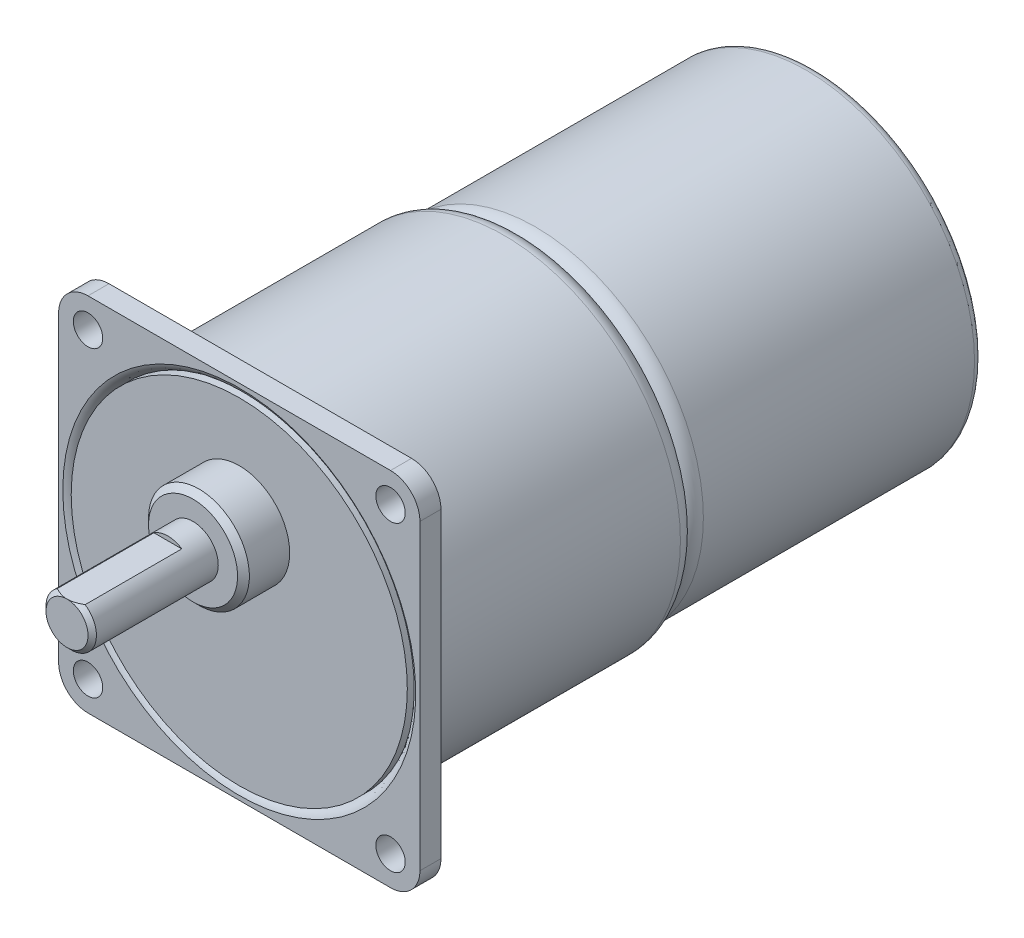
ISO-10303-21;
HEADER;
FILE_DESCRIPTION(('STEP AP214'),'2;1');
FILE_NAME('part.step','',(''),(''),'','','');
FILE_SCHEMA(('AUTOMOTIVE_DESIGN { 1 0 10303 214 1 1 1 1 }'));
ENDSEC;
DATA;
#1=APPLICATION_CONTEXT('core data for automotive mechanical design processes');
#2=APPLICATION_PROTOCOL_DEFINITION('international standard','automotive_design',2000,#1);
#3=PRODUCT_CONTEXT('',#1,'mechanical');
#4=PRODUCT('Part','Part','',(#3));
#5=PRODUCT_RELATED_PRODUCT_CATEGORY('part','',(#4));
#6=PRODUCT_DEFINITION_FORMATION('','',#4);
#7=PRODUCT_DEFINITION_CONTEXT('part definition',#1,'design');
#8=PRODUCT_DEFINITION('design','',#6,#7);
#9=PRODUCT_DEFINITION_SHAPE('','',#8);
#10=(LENGTH_UNIT() NAMED_UNIT(*) SI_UNIT(.MILLI.,.METRE.));
#11=(NAMED_UNIT(*) PLANE_ANGLE_UNIT() SI_UNIT($,.RADIAN.));
#12=(NAMED_UNIT(*) SI_UNIT($,.STERADIAN.) SOLID_ANGLE_UNIT());
#13=UNCERTAINTY_MEASURE_WITH_UNIT(LENGTH_MEASURE(1.E-05),#10,'distance_accuracy_value','');
#14=(GEOMETRIC_REPRESENTATION_CONTEXT(3) GLOBAL_UNCERTAINTY_ASSIGNED_CONTEXT((#13)) GLOBAL_UNIT_ASSIGNED_CONTEXT((#10,
#11,#12)) REPRESENTATION_CONTEXT('',''));
#15=CARTESIAN_POINT('',(0.,0.,0.));
#16=DIRECTION('',(0.,0.,1.));
#17=DIRECTION('',(1.,0.,0.));
#18=AXIS2_PLACEMENT_3D('',#15,#16,#17);
#19=CARTESIAN_POINT('',(3.5,-3.5,2.5));
#20=DIRECTION('',(0.,0.,1.));
#21=DIRECTION('',(1.,0.,0.));
#22=AXIS2_PLACEMENT_3D('',#19,#20,#21);
#23=PLANE('',#22);
#24=CARTESIAN_POINT('',(39.5,-39.5,2.5));
#25=DIRECTION('',(0.,0.,1.));
#26=DIRECTION('',(1.,0.,0.));
#27=AXIS2_PLACEMENT_3D('',#24,#25,#26);
#28=CIRCLE('',#27,1.75);
#29=CARTESIAN_POINT('',(41.25,-39.5,2.5));
#30=VERTEX_POINT('',#29);
#31=EDGE_CURVE('E148',#30,#30,#28,.T.);
#32=ORIENTED_EDGE('',*,*,#31,.F.);
#33=EDGE_LOOP('',(#32));
#34=FACE_BOUND('',#33,.T.);
#35=CARTESIAN_POINT('',(3.5,-39.5,2.5));
#36=DIRECTION('',(0.,0.,1.));
#37=DIRECTION('',(1.,0.,0.));
#38=AXIS2_PLACEMENT_3D('',#35,#36,#37);
#39=CIRCLE('',#38,1.75);
#40=CARTESIAN_POINT('',(5.25000000000001,-39.5,2.5));
#41=VERTEX_POINT('',#40);
#42=EDGE_CURVE('E160',#41,#41,#39,.T.);
#43=ORIENTED_EDGE('',*,*,#42,.F.);
#44=EDGE_LOOP('',(#43));
#45=FACE_BOUND('',#44,.T.);
#46=CARTESIAN_POINT('',(3.5,-3.5,2.5));
#47=DIRECTION('',(0.,0.,1.));
#48=DIRECTION('',(1.,0.,0.));
#49=AXIS2_PLACEMENT_3D('',#46,#47,#48);
#50=CIRCLE('',#49,3.5);
#51=CARTESIAN_POINT('',(3.50000000000002,0.,2.5));
#52=VERTEX_POINT('',#51);
#53=CARTESIAN_POINT('',(0.,-3.50000000000002,2.5));
#54=VERTEX_POINT('',#53);
#55=EDGE_CURVE('E172',#52,#54,#50,.T.);
#56=ORIENTED_EDGE('',*,*,#55,.T.);
#57=DIRECTION('',(0.,-1.,0.));
#58=VECTOR('',#57,1.);
#59=CARTESIAN_POINT('',(0.,-3.50000000000002,2.5));
#60=LINE('',#59,#58);
#61=CARTESIAN_POINT('',(0.,-39.5,2.5));
#62=VERTEX_POINT('',#61);
#63=EDGE_CURVE('E175',#54,#62,#60,.T.);
#64=ORIENTED_EDGE('',*,*,#63,.T.);
#65=CARTESIAN_POINT('',(3.5,-39.5,2.5));
#66=DIRECTION('',(0.,0.,1.));
#67=DIRECTION('',(1.,0.,0.));
#68=AXIS2_PLACEMENT_3D('',#65,#66,#67);
#69=CIRCLE('',#68,3.5);
#70=CARTESIAN_POINT('',(3.50000000000003,-43.,2.5));
#71=VERTEX_POINT('',#70);
#72=EDGE_CURVE('E178',#62,#71,#69,.T.);
#73=ORIENTED_EDGE('',*,*,#72,.T.);
#74=DIRECTION('',(1.,0.,0.));
#75=VECTOR('',#74,1.);
#76=CARTESIAN_POINT('',(3.50000000000003,-43.,2.5));
#77=LINE('',#76,#75);
#78=CARTESIAN_POINT('',(39.5,-43.,2.5));
#79=VERTEX_POINT('',#78);
#80=EDGE_CURVE('E180',#71,#79,#77,.T.);
#81=ORIENTED_EDGE('',*,*,#80,.T.);
#82=CARTESIAN_POINT('',(39.5,-39.5,2.5));
#83=DIRECTION('',(0.,0.,1.));
#84=DIRECTION('',(1.,0.,0.));
#85=AXIS2_PLACEMENT_3D('',#82,#83,#84);
#86=CIRCLE('',#85,3.5);
#87=CARTESIAN_POINT('',(43.,-39.5,2.5));
#88=VERTEX_POINT('',#87);
#89=EDGE_CURVE('E182',#79,#88,#86,.T.);
#90=ORIENTED_EDGE('',*,*,#89,.T.);
#91=DIRECTION('',(0.,1.,0.));
#92=VECTOR('',#91,1.);
#93=CARTESIAN_POINT('',(43.,-3.50000000000002,2.5));
#94=LINE('',#93,#92);
#95=CARTESIAN_POINT('',(43.,-3.50000000000002,2.5));
#96=VERTEX_POINT('',#95);
#97=EDGE_CURVE('E184',#88,#96,#94,.T.);
#98=ORIENTED_EDGE('',*,*,#97,.T.);
#99=CARTESIAN_POINT('',(39.5,-3.5,2.5));
#100=DIRECTION('',(0.,0.,1.));
#101=DIRECTION('',(-1.,0.,0.));
#102=AXIS2_PLACEMENT_3D('',#99,#100,#101);
#103=CIRCLE('',#102,3.5);
#104=CARTESIAN_POINT('',(39.5,0.,2.5));
#105=VERTEX_POINT('',#104);
#106=EDGE_CURVE('E186',#96,#105,#103,.T.);
#107=ORIENTED_EDGE('',*,*,#106,.T.);
#108=DIRECTION('',(-1.,0.,0.));
#109=VECTOR('',#108,1.);
#110=CARTESIAN_POINT('',(3.50000000000002,0.,2.5));
#111=LINE('',#110,#109);
#112=EDGE_CURVE('E188',#105,#52,#111,.T.);
#113=ORIENTED_EDGE('',*,*,#112,.T.);
#114=EDGE_LOOP('',(#56,#64,#73,#81,#90,#98,#107,#113));
#115=FACE_BOUND('',#114,.T.);
#116=CARTESIAN_POINT('',(39.5,-3.5,2.5));
#117=DIRECTION('',(0.,0.,1.));
#118=DIRECTION('',(1.,0.,0.));
#119=AXIS2_PLACEMENT_3D('',#116,#117,#118);
#120=CIRCLE('',#119,1.75);
#121=CARTESIAN_POINT('',(41.25,-3.5,2.5));
#122=VERTEX_POINT('',#121);
#123=EDGE_CURVE('E166',#122,#122,#120,.T.);
#124=ORIENTED_EDGE('',*,*,#123,.F.);
#125=EDGE_LOOP('',(#124));
#126=FACE_BOUND('',#125,.T.);
#127=CARTESIAN_POINT('',(3.5,-3.50000000000001,2.5));
#128=DIRECTION('',(0.,0.,1.));
#129=DIRECTION('',(1.,0.,0.));
#130=AXIS2_PLACEMENT_3D('',#127,#128,#129);
#131=CIRCLE('',#130,1.75);
#132=CARTESIAN_POINT('',(5.25,-3.50000000000001,2.5));
#133=VERTEX_POINT('',#132);
#134=EDGE_CURVE('E154',#133,#133,#131,.T.);
#135=ORIENTED_EDGE('',*,*,#134,.F.);
#136=EDGE_LOOP('',(#135));
#137=FACE_BOUND('',#136,.T.);
#138=CARTESIAN_POINT('',(21.5,-21.5,2.5));
#139=DIRECTION('',(0.,0.,-1.));
#140=DIRECTION('',(-1.,0.,0.));
#141=AXIS2_PLACEMENT_3D('',#138,#139,#140);
#142=CIRCLE('',#141,21.);
#143=CARTESIAN_POINT('',(0.500000000000011,-21.5,2.5));
#144=VERTEX_POINT('',#143);
#145=EDGE_CURVE('E132',#144,#144,#142,.T.);
#146=ORIENTED_EDGE('',*,*,#145,.T.);
#147=EDGE_LOOP('',(#146));
#148=FACE_BOUND('',#147,.T.);
#149=ADVANCED_FACE('F36',(#34,#45,#115,#126,#137,#148),#23,.T.);
#150=CARTESIAN_POINT('',(3.5,-3.5,0.));
#151=DIRECTION('',(0.,0.,1.));
#152=DIRECTION('',(1.,0.,0.));
#153=AXIS2_PLACEMENT_3D('',#150,#151,#152);
#154=PLANE('',#153);
#155=CARTESIAN_POINT('',(21.5,-21.5,0.));
#156=DIRECTION('',(0.,0.,1.));
#157=DIRECTION('',(1.,0.,0.));
#158=AXIS2_PLACEMENT_3D('',#155,#156,#157);
#159=CIRCLE('',#158,21.);
#160=CARTESIAN_POINT('',(42.5,-21.5,0.));
#161=VERTEX_POINT('',#160);
#162=EDGE_CURVE('E391',#161,#161,#159,.F.);
#163=ORIENTED_EDGE('',*,*,#162,.F.);
#164=EDGE_LOOP('',(#163));
#165=FACE_BOUND('',#164,.T.);
#166=CARTESIAN_POINT('',(3.5,-3.5,0.));
#167=DIRECTION('',(0.,0.,1.));
#168=DIRECTION('',(1.,0.,0.));
#169=AXIS2_PLACEMENT_3D('',#166,#167,#168);
#170=CIRCLE('',#169,3.5);
#171=CARTESIAN_POINT('',(3.50000000000002,0.,0.));
#172=VERTEX_POINT('',#171);
#173=CARTESIAN_POINT('',(0.,-3.50000000000002,0.));
#174=VERTEX_POINT('',#173);
#175=EDGE_CURVE('E169',#172,#174,#170,.T.);
#176=ORIENTED_EDGE('',*,*,#175,.F.);
#177=DIRECTION('',(-1.,0.,0.));
#178=VECTOR('',#177,1.);
#179=CARTESIAN_POINT('',(3.50000000000002,0.,0.));
#180=LINE('',#179,#178);
#181=CARTESIAN_POINT('',(39.5,0.,0.));
#182=VERTEX_POINT('',#181);
#183=EDGE_CURVE('E176',#182,#172,#180,.T.);
#184=ORIENTED_EDGE('',*,*,#183,.F.);
#185=CARTESIAN_POINT('',(39.5,-3.5,0.));
#186=DIRECTION('',(0.,0.,1.));
#187=DIRECTION('',(-1.,0.,0.));
#188=AXIS2_PLACEMENT_3D('',#185,#186,#187);
#189=CIRCLE('',#188,3.5);
#190=CARTESIAN_POINT('',(43.,-3.50000000000002,0.));
#191=VERTEX_POINT('',#190);
#192=EDGE_CURVE('E203',#191,#182,#189,.T.);
#193=ORIENTED_EDGE('',*,*,#192,.F.);
#194=DIRECTION('',(0.,1.,0.));
#195=VECTOR('',#194,1.);
#196=CARTESIAN_POINT('',(43.,-3.50000000000002,0.));
#197=LINE('',#196,#195);
#198=CARTESIAN_POINT('',(43.,-39.5,0.));
#199=VERTEX_POINT('',#198);
#200=EDGE_CURVE('E201',#199,#191,#197,.T.);
#201=ORIENTED_EDGE('',*,*,#200,.F.);
#202=CARTESIAN_POINT('',(39.5,-39.5,0.));
#203=DIRECTION('',(0.,0.,1.));
#204=DIRECTION('',(1.,0.,0.));
#205=AXIS2_PLACEMENT_3D('',#202,#203,#204);
#206=CIRCLE('',#205,3.5);
#207=CARTESIAN_POINT('',(39.5,-43.,0.));
#208=VERTEX_POINT('',#207);
#209=EDGE_CURVE('E199',#208,#199,#206,.T.);
#210=ORIENTED_EDGE('',*,*,#209,.F.);
#211=DIRECTION('',(1.,0.,0.));
#212=VECTOR('',#211,1.);
#213=CARTESIAN_POINT('',(3.50000000000003,-43.,0.));
#214=LINE('',#213,#212);
#215=CARTESIAN_POINT('',(3.50000000000003,-43.,0.));
#216=VERTEX_POINT('',#215);
#217=EDGE_CURVE('E197',#216,#208,#214,.T.);
#218=ORIENTED_EDGE('',*,*,#217,.F.);
#219=CARTESIAN_POINT('',(3.5,-39.5,0.));
#220=DIRECTION('',(0.,0.,1.));
#221=DIRECTION('',(1.,0.,0.));
#222=AXIS2_PLACEMENT_3D('',#219,#220,#221);
#223=CIRCLE('',#222,3.5);
#224=CARTESIAN_POINT('',(0.,-39.5,0.));
#225=VERTEX_POINT('',#224);
#226=EDGE_CURVE('E195',#225,#216,#223,.T.);
#227=ORIENTED_EDGE('',*,*,#226,.F.);
#228=DIRECTION('',(0.,-1.,0.));
#229=VECTOR('',#228,1.);
#230=CARTESIAN_POINT('',(0.,-3.50000000000002,0.));
#231=LINE('',#230,#229);
#232=EDGE_CURVE('E193',#174,#225,#231,.T.);
#233=ORIENTED_EDGE('',*,*,#232,.F.);
#234=EDGE_LOOP('',(#176,#184,#193,#201,#210,#218,#227,#233));
#235=FACE_BOUND('',#234,.T.);
#236=CARTESIAN_POINT('',(39.5,-3.5,0.));
#237=DIRECTION('',(0.,0.,1.));
#238=DIRECTION('',(1.,0.,0.));
#239=AXIS2_PLACEMENT_3D('',#236,#237,#238);
#240=CIRCLE('',#239,1.75);
#241=CARTESIAN_POINT('',(41.25,-3.5,0.));
#242=VERTEX_POINT('',#241);
#243=EDGE_CURVE('E163',#242,#242,#240,.T.);
#244=ORIENTED_EDGE('',*,*,#243,.T.);
#245=EDGE_LOOP('',(#244));
#246=FACE_BOUND('',#245,.T.);
#247=CARTESIAN_POINT('',(3.5,-39.5,0.));
#248=DIRECTION('',(0.,0.,1.));
#249=DIRECTION('',(1.,0.,0.));
#250=AXIS2_PLACEMENT_3D('',#247,#248,#249);
#251=CIRCLE('',#250,1.75);
#252=CARTESIAN_POINT('',(5.25000000000001,-39.5,0.));
#253=VERTEX_POINT('',#252);
#254=EDGE_CURVE('E157',#253,#253,#251,.T.);
#255=ORIENTED_EDGE('',*,*,#254,.T.);
#256=EDGE_LOOP('',(#255));
#257=FACE_BOUND('',#256,.T.);
#258=CARTESIAN_POINT('',(3.5,-3.50000000000001,0.));
#259=DIRECTION('',(0.,0.,1.));
#260=DIRECTION('',(1.,0.,0.));
#261=AXIS2_PLACEMENT_3D('',#258,#259,#260);
#262=CIRCLE('',#261,1.75);
#263=CARTESIAN_POINT('',(5.25,-3.50000000000001,0.));
#264=VERTEX_POINT('',#263);
#265=EDGE_CURVE('E151',#264,#264,#262,.T.);
#266=ORIENTED_EDGE('',*,*,#265,.T.);
#267=EDGE_LOOP('',(#266));
#268=FACE_BOUND('',#267,.T.);
#269=CARTESIAN_POINT('',(39.5,-39.5,0.));
#270=DIRECTION('',(0.,0.,1.));
#271=DIRECTION('',(1.,0.,0.));
#272=AXIS2_PLACEMENT_3D('',#269,#270,#271);
#273=CIRCLE('',#272,1.75);
#274=CARTESIAN_POINT('',(41.25,-39.5,0.));
#275=VERTEX_POINT('',#274);
#276=EDGE_CURVE('E147',#275,#275,#273,.T.);
#277=ORIENTED_EDGE('',*,*,#276,.T.);
#278=EDGE_LOOP('',(#277));
#279=FACE_BOUND('',#278,.T.);
#280=ADVANCED_FACE('F296',(#165,#235,#246,#257,#268,#279),#154,.F.);
#281=CARTESIAN_POINT('',(3.5,-3.5,2.5));
#282=DIRECTION('',(0.,0.,-1.));
#283=DIRECTION('',(-1.,0.,0.));
#284=AXIS2_PLACEMENT_3D('',#281,#282,#283);
#285=CYLINDRICAL_SURFACE('',#284,3.5);
#286=ORIENTED_EDGE('',*,*,#175,.T.);
#287=DIRECTION('',(0.,0.,-1.));
#288=VECTOR('',#287,1.);
#289=CARTESIAN_POINT('',(0.,-3.50000000000002,2.5));
#290=LINE('',#289,#288);
#291=EDGE_CURVE('E144',#54,#174,#290,.T.);
#292=ORIENTED_EDGE('',*,*,#291,.F.);
#293=ORIENTED_EDGE('',*,*,#55,.F.);
#294=DIRECTION('',(0.,0.,-1.));
#295=VECTOR('',#294,1.);
#296=CARTESIAN_POINT('',(3.50000000000002,0.,2.5));
#297=LINE('',#296,#295);
#298=EDGE_CURVE('E190',#52,#172,#297,.T.);
#299=ORIENTED_EDGE('',*,*,#298,.T.);
#300=EDGE_LOOP('',(#286,#292,#293,#299));
#301=FACE_BOUND('',#300,.T.);
#302=ADVANCED_FACE('F300',(#301),#285,.T.);
#303=CARTESIAN_POINT('',(0.,-3.50000000000002,2.5));
#304=DIRECTION('',(1.,0.,0.));
#305=DIRECTION('',(0.,1.,0.));
#306=AXIS2_PLACEMENT_3D('',#303,#304,#305);
#307=PLANE('',#306);
#308=ORIENTED_EDGE('',*,*,#232,.T.);
#309=DIRECTION('',(0.,0.,-1.));
#310=VECTOR('',#309,1.);
#311=CARTESIAN_POINT('',(0.,-39.5,2.5));
#312=LINE('',#311,#310);
#313=EDGE_CURVE('E223',#62,#225,#312,.T.);
#314=ORIENTED_EDGE('',*,*,#313,.F.);
#315=ORIENTED_EDGE('',*,*,#63,.F.);
#316=ORIENTED_EDGE('',*,*,#291,.T.);
#317=EDGE_LOOP('',(#308,#314,#315,#316));
#318=FACE_BOUND('',#317,.T.);
#319=ADVANCED_FACE('F324',(#318),#307,.F.);
#320=CARTESIAN_POINT('',(3.5,-39.5,2.5));
#321=DIRECTION('',(0.,0.,-1.));
#322=DIRECTION('',(-1.,0.,0.));
#323=AXIS2_PLACEMENT_3D('',#320,#321,#322);
#324=CYLINDRICAL_SURFACE('',#323,3.5);
#325=ORIENTED_EDGE('',*,*,#226,.T.);
#326=DIRECTION('',(0.,0.,-1.));
#327=VECTOR('',#326,1.);
#328=CARTESIAN_POINT('',(3.50000000000003,-43.,2.5));
#329=LINE('',#328,#327);
#330=EDGE_CURVE('E220',#71,#216,#329,.T.);
#331=ORIENTED_EDGE('',*,*,#330,.F.);
#332=ORIENTED_EDGE('',*,*,#72,.F.);
#333=ORIENTED_EDGE('',*,*,#313,.T.);
#334=EDGE_LOOP('',(#325,#331,#332,#333));
#335=FACE_BOUND('',#334,.T.);
#336=ADVANCED_FACE('F320',(#335),#324,.T.);
#337=CARTESIAN_POINT('',(3.50000000000003,-43.,2.5));
#338=DIRECTION('',(0.,1.,0.));
#339=DIRECTION('',(0.,0.,1.));
#340=AXIS2_PLACEMENT_3D('',#337,#338,#339);
#341=PLANE('',#340);
#342=ORIENTED_EDGE('',*,*,#217,.T.);
#343=DIRECTION('',(0.,0.,-1.));
#344=VECTOR('',#343,1.);
#345=CARTESIAN_POINT('',(39.5,-43.,2.5));
#346=LINE('',#345,#344);
#347=EDGE_CURVE('E217',#79,#208,#346,.T.);
#348=ORIENTED_EDGE('',*,*,#347,.F.);
#349=ORIENTED_EDGE('',*,*,#80,.F.);
#350=ORIENTED_EDGE('',*,*,#330,.T.);
#351=EDGE_LOOP('',(#342,#348,#349,#350));
#352=FACE_BOUND('',#351,.T.);
#353=ADVANCED_FACE('F316',(#352),#341,.F.);
#354=CARTESIAN_POINT('',(39.5,-39.5,2.5));
#355=DIRECTION('',(0.,0.,-1.));
#356=DIRECTION('',(-1.,0.,0.));
#357=AXIS2_PLACEMENT_3D('',#354,#355,#356);
#358=CYLINDRICAL_SURFACE('',#357,3.5);
#359=ORIENTED_EDGE('',*,*,#209,.T.);
#360=DIRECTION('',(0.,0.,-1.));
#361=VECTOR('',#360,1.);
#362=CARTESIAN_POINT('',(43.,-39.5,2.5));
#363=LINE('',#362,#361);
#364=EDGE_CURVE('E214',#88,#199,#363,.T.);
#365=ORIENTED_EDGE('',*,*,#364,.F.);
#366=ORIENTED_EDGE('',*,*,#89,.F.);
#367=ORIENTED_EDGE('',*,*,#347,.T.);
#368=EDGE_LOOP('',(#359,#365,#366,#367));
#369=FACE_BOUND('',#368,.T.);
#370=ADVANCED_FACE('F312',(#369),#358,.T.);
#371=CARTESIAN_POINT('',(43.,-3.50000000000002,2.5));
#372=DIRECTION('',(-1.,0.,0.));
#373=DIRECTION('',(0.,-1.,0.));
#374=AXIS2_PLACEMENT_3D('',#371,#372,#373);
#375=PLANE('',#374);
#376=ORIENTED_EDGE('',*,*,#200,.T.);
#377=DIRECTION('',(0.,0.,-1.));
#378=VECTOR('',#377,1.);
#379=CARTESIAN_POINT('',(43.,-3.50000000000002,2.5));
#380=LINE('',#379,#378);
#381=EDGE_CURVE('E211',#96,#191,#380,.T.);
#382=ORIENTED_EDGE('',*,*,#381,.F.);
#383=ORIENTED_EDGE('',*,*,#97,.F.);
#384=ORIENTED_EDGE('',*,*,#364,.T.);
#385=EDGE_LOOP('',(#376,#382,#383,#384));
#386=FACE_BOUND('',#385,.T.);
#387=ADVANCED_FACE('F308',(#386),#375,.F.);
#388=CARTESIAN_POINT('',(39.5,-3.5,2.5));
#389=DIRECTION('',(0.,0.,-1.));
#390=DIRECTION('',(-1.,0.,0.));
#391=AXIS2_PLACEMENT_3D('',#388,#389,#390);
#392=CYLINDRICAL_SURFACE('',#391,3.5);
#393=ORIENTED_EDGE('',*,*,#192,.T.);
#394=DIRECTION('',(0.,0.,-1.));
#395=VECTOR('',#394,1.);
#396=CARTESIAN_POINT('',(39.5,0.,2.5));
#397=LINE('',#396,#395);
#398=EDGE_CURVE('E208',#105,#182,#397,.T.);
#399=ORIENTED_EDGE('',*,*,#398,.F.);
#400=ORIENTED_EDGE('',*,*,#106,.F.);
#401=ORIENTED_EDGE('',*,*,#381,.T.);
#402=EDGE_LOOP('',(#393,#399,#400,#401));
#403=FACE_BOUND('',#402,.T.);
#404=ADVANCED_FACE('F304',(#403),#392,.T.);
#405=CARTESIAN_POINT('',(3.50000000000002,0.,2.5));
#406=DIRECTION('',(0.,-1.,0.));
#407=DIRECTION('',(0.,0.,-1.));
#408=AXIS2_PLACEMENT_3D('',#405,#406,#407);
#409=PLANE('',#408);
#410=ORIENTED_EDGE('',*,*,#183,.T.);
#411=ORIENTED_EDGE('',*,*,#298,.F.);
#412=ORIENTED_EDGE('',*,*,#112,.F.);
#413=ORIENTED_EDGE('',*,*,#398,.T.);
#414=EDGE_LOOP('',(#410,#411,#412,#413));
#415=FACE_BOUND('',#414,.T.);
#416=ADVANCED_FACE('F292',(#415),#409,.F.);
#417=CARTESIAN_POINT('',(39.5,-3.5,2.5));
#418=DIRECTION('',(0.,0.,-1.));
#419=DIRECTION('',(-1.,0.,0.));
#420=AXIS2_PLACEMENT_3D('',#417,#418,#419);
#421=CYLINDRICAL_SURFACE('',#420,1.75);
#422=ORIENTED_EDGE('',*,*,#123,.T.);
#423=EDGE_LOOP('',(#422));
#424=FACE_BOUND('',#423,.T.);
#425=ORIENTED_EDGE('',*,*,#243,.F.);
#426=EDGE_LOOP('',(#425));
#427=FACE_BOUND('',#426,.T.);
#428=ADVANCED_FACE('F288',(#424,#427),#421,.F.);
#429=CARTESIAN_POINT('',(3.5,-39.5,2.5));
#430=DIRECTION('',(0.,0.,-1.));
#431=DIRECTION('',(-1.,0.,0.));
#432=AXIS2_PLACEMENT_3D('',#429,#430,#431);
#433=CYLINDRICAL_SURFACE('',#432,1.75);
#434=ORIENTED_EDGE('',*,*,#42,.T.);
#435=EDGE_LOOP('',(#434));
#436=FACE_BOUND('',#435,.T.);
#437=ORIENTED_EDGE('',*,*,#254,.F.);
#438=EDGE_LOOP('',(#437));
#439=FACE_BOUND('',#438,.T.);
#440=ADVANCED_FACE('F284',(#436,#439),#433,.F.);
#441=CARTESIAN_POINT('',(3.5,-3.50000000000001,2.5));
#442=DIRECTION('',(0.,0.,-1.));
#443=DIRECTION('',(-1.,0.,0.));
#444=AXIS2_PLACEMENT_3D('',#441,#442,#443);
#445=CYLINDRICAL_SURFACE('',#444,1.75);
#446=ORIENTED_EDGE('',*,*,#134,.T.);
#447=EDGE_LOOP('',(#446));
#448=FACE_BOUND('',#447,.T.);
#449=ORIENTED_EDGE('',*,*,#265,.F.);
#450=EDGE_LOOP('',(#449));
#451=FACE_BOUND('',#450,.T.);
#452=ADVANCED_FACE('F280',(#448,#451),#445,.F.);
#453=CARTESIAN_POINT('',(39.5,-39.5,2.5));
#454=DIRECTION('',(0.,0.,-1.));
#455=DIRECTION('',(-1.,0.,0.));
#456=AXIS2_PLACEMENT_3D('',#453,#454,#455);
#457=CYLINDRICAL_SURFACE('',#456,1.75);
#458=ORIENTED_EDGE('',*,*,#31,.T.);
#459=EDGE_LOOP('',(#458));
#460=FACE_BOUND('',#459,.T.);
#461=ORIENTED_EDGE('',*,*,#276,.F.);
#462=EDGE_LOOP('',(#461));
#463=FACE_BOUND('',#462,.T.);
#464=ADVANCED_FACE('F277',(#460,#463),#457,.F.);
#465=CARTESIAN_POINT('',(21.5,-21.5,-31.));
#466=DIRECTION('',(0.,0.,1.));
#467=DIRECTION('',(1.,0.,0.));
#468=AXIS2_PLACEMENT_3D('',#465,#466,#467);
#469=CYLINDRICAL_SURFACE('',#468,21.);
#470=CARTESIAN_POINT('',(21.5,-21.5,-29.));
#471=DIRECTION('',(0.,0.,-1.));
#472=DIRECTION('',(-1.,0.,0.));
#473=AXIS2_PLACEMENT_3D('',#470,#471,#472);
#474=CIRCLE('',#473,21.);
#475=CARTESIAN_POINT('',(0.5,-21.5,-29.));
#476=VERTEX_POINT('',#475);
#477=EDGE_CURVE('E382',#476,#476,#474,.F.);
#478=ORIENTED_EDGE('',*,*,#477,.T.);
#479=EDGE_LOOP('',(#478));
#480=FACE_BOUND('',#479,.T.);
#481=ORIENTED_EDGE('',*,*,#162,.T.);
#482=EDGE_LOOP('',(#481));
#483=FACE_BOUND('',#482,.T.);
#484=ADVANCED_FACE('F255',(#480,#483),#469,.T.);
#485=CARTESIAN_POINT('',(21.5,-21.5,-29.));
#486=DIRECTION('',(0.,0.,-1.));
#487=DIRECTION('',(-1.,0.,0.));
#488=AXIS2_PLACEMENT_3D('',#485,#486,#487);
#489=TOROIDAL_SURFACE('',#488,19.,2.);
#490=ORIENTED_EDGE('',*,*,#477,.F.);
#491=EDGE_LOOP('',(#490));
#492=FACE_BOUND('',#491,.T.);
#493=CARTESIAN_POINT('',(21.5,-21.5,-31.));
#494=DIRECTION('',(0.,0.,-1.));
#495=DIRECTION('',(-1.,0.,0.));
#496=AXIS2_PLACEMENT_3D('',#493,#494,#495);
#497=CIRCLE('',#496,19.);
#498=CARTESIAN_POINT('',(2.5,-21.5,-31.));
#499=VERTEX_POINT('',#498);
#500=EDGE_CURVE('E386',#499,#499,#497,.T.);
#501=ORIENTED_EDGE('',*,*,#500,.F.);
#502=EDGE_LOOP('',(#501));
#503=FACE_BOUND('',#502,.T.);
#504=ADVANCED_FACE('F370',(#492,#503),#489,.T.);
#505=CARTESIAN_POINT('',(21.5,-21.5,-66.));
#506=DIRECTION('',(0.,0.,1.));
#507=DIRECTION('',(1.,0.,0.));
#508=AXIS2_PLACEMENT_3D('',#505,#506,#507);
#509=CYLINDRICAL_SURFACE('',#508,20.);
#510=CARTESIAN_POINT('',(21.5,-21.5,-65.));
#511=DIRECTION('',(0.,0.,-1.));
#512=DIRECTION('',(-1.,0.,0.));
#513=AXIS2_PLACEMENT_3D('',#510,#511,#512);
#514=CIRCLE('',#513,20.);
#515=CARTESIAN_POINT('',(1.5,-21.5,-65.));
#516=VERTEX_POINT('',#515);
#517=EDGE_CURVE('E11',#516,#516,#514,.F.);
#518=ORIENTED_EDGE('',*,*,#517,.T.);
#519=EDGE_LOOP('',(#518));
#520=FACE_BOUND('',#519,.T.);
#521=CARTESIAN_POINT('',(21.5,-21.5,-32.7320508075689));
#522=DIRECTION('',(0.,0.,1.));
#523=DIRECTION('',(1.,0.,0.));
#524=AXIS2_PLACEMENT_3D('',#521,#522,#523);
#525=CIRCLE('',#524,20.);
#526=CARTESIAN_POINT('',(41.5,-21.5,-32.7320508075689));
#527=VERTEX_POINT('',#526);
#528=EDGE_CURVE('E380',#527,#527,#525,.F.);
#529=ORIENTED_EDGE('',*,*,#528,.T.);
#530=EDGE_LOOP('',(#529));
#531=FACE_BOUND('',#530,.T.);
#532=ADVANCED_FACE('F367',(#520,#531),#509,.T.);
#533=CARTESIAN_POINT('',(21.5,-21.5,-66.));
#534=DIRECTION('',(0.,0.,-1.));
#535=DIRECTION('',(-1.,0.,0.));
#536=AXIS2_PLACEMENT_3D('',#533,#534,#535);
#537=PLANE('',#536);
#538=CARTESIAN_POINT('',(21.5,-21.5,-66.));
#539=DIRECTION('',(0.,0.,-1.));
#540=DIRECTION('',(-1.,0.,0.));
#541=AXIS2_PLACEMENT_3D('',#538,#539,#540);
#542=CIRCLE('',#541,19.);
#543=CARTESIAN_POINT('',(2.5,-21.5,-66.));
#544=VERTEX_POINT('',#543);
#545=EDGE_CURVE('E44',#544,#544,#542,.T.);
#546=ORIENTED_EDGE('',*,*,#545,.T.);
#547=EDGE_LOOP('',(#546));
#548=FACE_BOUND('',#547,.T.);
#549=ADVANCED_FACE('F364',(#548),#537,.T.);
#550=CARTESIAN_POINT('',(21.5,-21.5,-32.7320508075689));
#551=DIRECTION('',(0.,0.,1.));
#552=DIRECTION('',(1.,0.,0.));
#553=AXIS2_PLACEMENT_3D('',#550,#551,#552);
#554=TOROIDAL_SURFACE('',#553,18.,2.);
#555=ORIENTED_EDGE('',*,*,#500,.T.);
#556=EDGE_LOOP('',(#555));
#557=FACE_BOUND('',#556,.T.);
#558=ORIENTED_EDGE('',*,*,#528,.F.);
#559=EDGE_LOOP('',(#558));
#560=FACE_BOUND('',#559,.T.);
#561=ADVANCED_FACE('F366',(#557,#560),#554,.T.);
#562=CARTESIAN_POINT('',(21.5,-21.5,-65.));
#563=DIRECTION('',(0.,0.,-1.));
#564=DIRECTION('',(-1.,0.,0.));
#565=AXIS2_PLACEMENT_3D('',#562,#563,#564);
#566=TOROIDAL_SURFACE('',#565,19.,1.);
#567=ORIENTED_EDGE('',*,*,#517,.F.);
#568=EDGE_LOOP('',(#567));
#569=FACE_BOUND('',#568,.T.);
#570=ORIENTED_EDGE('',*,*,#545,.F.);
#571=EDGE_LOOP('',(#570));
#572=FACE_BOUND('',#571,.T.);
#573=ADVANCED_FACE('F38',(#569,#572),#566,.T.);
#574=CARTESIAN_POINT('',(21.5,-1.50000000000001,1.5));
#575=CARTESIAN_POINT('',(21.5,-1.20000000000001,2.2));
#576=CARTESIAN_POINT('',(21.5,-0.500000000000009,2.5));
#577=B_SPLINE_CURVE_WITH_KNOTS('',2,(#574,#575,#576),.UNSPECIFIED.,.F.,.F.,(3,3),(0.,1.),.UNSPECIFIED.);
#578=CARTESIAN_POINT('',(21.5,-21.5,-66.));
#579=DIRECTION('',(0.,0.,-1.));
#580=AXIS1_PLACEMENT('',#578,#579);
#581=SURFACE_OF_REVOLUTION('',#577,#580);
#582=ORIENTED_EDGE('',*,*,#145,.F.);
#583=EDGE_LOOP('',(#582));
#584=FACE_BOUND('',#583,.T.);
#585=CARTESIAN_POINT('',(21.5,-21.5,1.5));
#586=DIRECTION('',(0.,0.,-1.));
#587=DIRECTION('',(-1.,0.,0.));
#588=AXIS2_PLACEMENT_3D('',#585,#586,#587);
#589=CIRCLE('',#588,20.);
#590=CARTESIAN_POINT('',(1.5,-21.5,1.5));
#591=VERTEX_POINT('',#590);
#592=EDGE_CURVE('E136',#591,#591,#589,.T.);
#593=ORIENTED_EDGE('',*,*,#592,.T.);
#594=EDGE_LOOP('',(#593));
#595=FACE_BOUND('',#594,.T.);
#596=ADVANCED_FACE('F359',(#584,#595),#581,.T.);
#597=CARTESIAN_POINT('',(21.5,-21.5,-66.));
#598=DIRECTION('',(0.,0.,-1.));
#599=DIRECTION('',(-1.,0.,0.));
#600=AXIS2_PLACEMENT_3D('',#597,#598,#599);
#601=CYLINDRICAL_SURFACE('',#600,20.);
#602=ORIENTED_EDGE('',*,*,#592,.F.);
#603=EDGE_LOOP('',(#602));
#604=FACE_BOUND('',#603,.T.);
#605=CARTESIAN_POINT('',(21.5,-21.5,2.5));
#606=DIRECTION('',(0.,0.,-1.));
#607=DIRECTION('',(-1.,0.,0.));
#608=AXIS2_PLACEMENT_3D('',#605,#606,#607);
#609=CIRCLE('',#608,20.);
#610=CARTESIAN_POINT('',(1.5,-21.5,2.5));
#611=VERTEX_POINT('',#610);
#612=EDGE_CURVE('E347',#611,#611,#609,.T.);
#613=ORIENTED_EDGE('',*,*,#612,.T.);
#614=EDGE_LOOP('',(#613));
#615=FACE_BOUND('',#614,.T.);
#616=ADVANCED_FACE('F263',(#604,#615),#601,.T.);
#617=CARTESIAN_POINT('',(21.5,-14.5,23.));
#618=DIRECTION('',(0.,0.,1.));
#619=DIRECTION('',(1.,0.,0.));
#620=AXIS2_PLACEMENT_3D('',#617,#618,#619);
#621=PLANE('',#620);
#622=CARTESIAN_POINT('',(21.5,-14.5,23.));
#623=DIRECTION('',(0.,0.,1.));
#624=DIRECTION('',(1.,0.,0.));
#625=AXIS2_PLACEMENT_3D('',#622,#623,#624);
#626=CIRCLE('',#625,2.50000000000001);
#627=CARTESIAN_POINT('',(21.5,-12.,23.));
#628=VERTEX_POINT('',#627);
#629=EDGE_CURVE('E128',#628,#628,#626,.T.);
#630=ORIENTED_EDGE('',*,*,#629,.T.);
#631=EDGE_LOOP('',(#630));
#632=FACE_BOUND('',#631,.T.);
#633=ADVANCED_FACE('F260',(#632),#621,.T.);
#634=CARTESIAN_POINT('',(0.,-9.19999999999997,11.));
#635=DIRECTION('',(0.,0.,-1.));
#636=DIRECTION('',(-1.,0.,0.));
#637=AXIS2_PLACEMENT_3D('',#634,#635,#636);
#638=PLANE('',#637);
#639=DIRECTION('',(1.,0.,0.));
#640=VECTOR('',#639,1.);
#641=CARTESIAN_POINT('',(0.,-12.,11.));
#642=LINE('',#641,#640);
#643=CARTESIAN_POINT('',(19.8416876048223,-12.,11.));
#644=VERTEX_POINT('',#643);
#645=CARTESIAN_POINT('',(23.1583123951777,-12.,11.));
#646=VERTEX_POINT('',#645);
#647=EDGE_CURVE('E127',#644,#646,#642,.T.);
#648=ORIENTED_EDGE('',*,*,#647,.T.);
#649=CARTESIAN_POINT('',(21.5,-14.5,11.));
#650=DIRECTION('',(0.,0.,-1.));
#651=DIRECTION('',(-1.,0.,0.));
#652=AXIS2_PLACEMENT_3D('',#649,#650,#651);
#653=CIRCLE('',#652,3.);
#654=EDGE_CURVE('E118',#644,#646,#653,.T.);
#655=ORIENTED_EDGE('',*,*,#654,.F.);
#656=EDGE_LOOP('',(#648,#655));
#657=FACE_BOUND('',#656,.T.);
#658=ADVANCED_FACE('F126',(#657),#638,.F.);
#659=CARTESIAN_POINT('',(21.5,-14.5,23.));
#660=DIRECTION('',(0.,0.,-1.));
#661=DIRECTION('',(-1.,0.,0.));
#662=AXIS2_PLACEMENT_3D('',#659,#660,#661);
#663=CONICAL_SURFACE('',#662,2.50000000000001,0.785398163397436);
#664=CARTESIAN_POINT('',(19.8416876048223,-12.,22.5));
#665=CARTESIAN_POINT('',(19.8869558092873,-12.,22.5250200255843));
#666=CARTESIAN_POINT('',(19.9325221824897,-12.,22.549499427219));
#667=CARTESIAN_POINT('',(20.0242863684501,-12.,22.5972096867305));
#668=CARTESIAN_POINT('',(20.0704839946572,-12.,22.6204409038781));
#669=CARTESIAN_POINT('',(20.2105310174965,-12.,22.6882337414681));
#670=CARTESIAN_POINT('',(20.3054318270427,-12.,22.7306685534991));
#671=CARTESIAN_POINT('',(20.4956416733889,-12.,22.8071641313579));
#672=CARTESIAN_POINT('',(20.5908718331429,-12.,22.8414185932365));
#673=CARTESIAN_POINT('',(20.7840390035972,-12.,22.9011186383457));
#674=CARTESIAN_POINT('',(20.8819740240833,-12.,22.9265705213043));
#675=CARTESIAN_POINT('',(21.065903468962,-12.,22.96395141614));
#676=CARTESIAN_POINT('',(21.1516048680796,-12.,22.9772928993308));
#677=CARTESIAN_POINT('',(21.2812937670291,-12.,22.9908266543301));
#678=CARTESIAN_POINT('',(21.3249577251129,-12.,22.9942588205655));
#679=CARTESIAN_POINT('',(21.4124118149783,-12.,22.9988484547413));
#680=CARTESIAN_POINT('',(21.4562019662452,-12.,23.0000055502065));
#681=CARTESIAN_POINT('',(21.5,-12.,23.));
#682=B_SPLINE_CURVE_WITH_KNOTS('',3,(#664,#665,#666,#667,#668,#669,#670,#671,#672,#673,#674,
#675,#676,#677,#678,#679,#680,#681),.UNSPECIFIED.,.F.,.F.,(4,2,2,2,2,2,2,2,4),(0.,
0.155160114661544,0.31027532695393,0.621889187467562,0.925164565305222,1.22822244720192,
1.48798349653101,1.6193260244773,1.75069005406606),.UNSPECIFIED.);
#683=CARTESIAN_POINT('',(19.8416876048223,-12.,22.5));
#684=VERTEX_POINT('',#683);
#685=EDGE_CURVE('E234',#684,#628,#682,.T.);
#686=ORIENTED_EDGE('',*,*,#685,.F.);
#687=CARTESIAN_POINT('',(21.5,-14.5,22.5));
#688=DIRECTION('',(0.,0.,1.));
#689=DIRECTION('',(1.,0.,0.));
#690=AXIS2_PLACEMENT_3D('',#687,#688,#689);
#691=CIRCLE('',#690,3.);
#692=CARTESIAN_POINT('',(23.1583123951777,-12.,22.5));
#693=VERTEX_POINT('',#692);
#694=EDGE_CURVE('E51',#693,#684,#691,.F.);
#695=ORIENTED_EDGE('',*,*,#694,.F.);
#696=CARTESIAN_POINT('',(21.5,-12.,23.));
#697=CARTESIAN_POINT('',(21.5768428391804,-12.,23.0000643176382));
#698=CARTESIAN_POINT('',(21.6536466194403,-12.,22.9964585669139));
#699=CARTESIAN_POINT('',(21.8064869139906,-12.,22.9824138186157));
#700=CARTESIAN_POINT('',(21.8825246046146,-12.,22.9719877566791));
#701=CARTESIAN_POINT('',(22.0322312015983,-12.,22.9450231886171));
#702=CARTESIAN_POINT('',(22.1059185430151,-12.,22.9285851348585));
#703=CARTESIAN_POINT('',(22.2518971631067,-12.,22.8903277696489));
#704=CARTESIAN_POINT('',(22.3241878856246,-12.,22.8685063602177));
#705=CARTESIAN_POINT('',(22.4613612045594,-12.,22.8222417065684));
#706=CARTESIAN_POINT('',(22.5263666258639,-12.,22.7981581621012));
#707=CARTESIAN_POINT('',(22.6550556235554,-12.,22.7466971992364));
#708=CARTESIAN_POINT('',(22.7187391432398,-12.,22.7193196398837));
#709=CARTESIAN_POINT('',(22.8458135100177,-12.,22.6613450460912));
#710=CARTESIAN_POINT('',(22.9091843596214,-12.,22.6307045192353));
#711=CARTESIAN_POINT('',(23.0346611360263,-12.,22.567035036112));
#712=CARTESIAN_POINT('',(23.0967679305976,-12.,22.5340077944289));
#713=CARTESIAN_POINT('',(23.1583123951777,-12.,22.5));
#714=B_SPLINE_CURVE_WITH_KNOTS('',3,(#696,#697,#698,#699,#700,#701,#702,#703,#704,#705,#706,
#707,#708,#709,#710,#711,#712,#713),.UNSPECIFIED.,.F.,.F.,(4,2,2,2,2,2,2,2,4),(0.,
0.230381722715159,0.460327757459287,0.6865952197028,0.912951001700734,1.12081935764499,
1.32869661170076,1.53981070703045,1.75077462023261),.UNSPECIFIED.);
#715=EDGE_CURVE('E59',#628,#693,#714,.T.);
#716=ORIENTED_EDGE('',*,*,#715,.F.);
#717=ORIENTED_EDGE('',*,*,#629,.F.);
#718=EDGE_LOOP('',(#686,#695,#716,#717));
#719=FACE_BOUND('',#718,.T.);
#720=ADVANCED_FACE('F247',(#719),#663,.T.);
#721=CARTESIAN_POINT('',(0.,-12.,11.));
#722=DIRECTION('',(0.,-1.,0.));
#723=DIRECTION('',(1.,0.,0.));
#724=AXIS2_PLACEMENT_3D('',#721,#722,#723);
#725=PLANE('',#724);
#726=ORIENTED_EDGE('',*,*,#685,.T.);
#727=ORIENTED_EDGE('',*,*,#715,.T.);
#728=DIRECTION('',(0.,0.,-1.));
#729=VECTOR('',#728,1.);
#730=CARTESIAN_POINT('',(23.1583123951777,-12.,23.));
#731=LINE('',#730,#729);
#732=EDGE_CURVE('E122',#646,#693,#731,.F.);
#733=ORIENTED_EDGE('',*,*,#732,.F.);
#734=ORIENTED_EDGE('',*,*,#647,.F.);
#735=DIRECTION('',(0.,0.,-1.));
#736=VECTOR('',#735,1.);
#737=CARTESIAN_POINT('',(19.8416876048223,-12.,23.));
#738=LINE('',#737,#736);
#739=EDGE_CURVE('E114',#684,#644,#738,.T.);
#740=ORIENTED_EDGE('',*,*,#739,.F.);
#741=EDGE_LOOP('',(#726,#727,#733,#734,#740));
#742=FACE_BOUND('',#741,.T.);
#743=ADVANCED_FACE('F131',(#742),#725,.F.);
#744=CARTESIAN_POINT('',(21.5,-14.5,23.));
#745=DIRECTION('',(0.,0.,-1.));
#746=DIRECTION('',(-1.,0.,0.));
#747=AXIS2_PLACEMENT_3D('',#744,#745,#746);
#748=CYLINDRICAL_SURFACE('',#747,3.);
#749=ORIENTED_EDGE('',*,*,#732,.T.);
#750=ORIENTED_EDGE('',*,*,#694,.T.);
#751=ORIENTED_EDGE('',*,*,#739,.T.);
#752=ORIENTED_EDGE('',*,*,#654,.T.);
#753=EDGE_LOOP('',(#749,#750,#751,#752));
#754=FACE_BOUND('',#753,.T.);
#755=CARTESIAN_POINT('',(21.5,-14.5,8.));
#756=DIRECTION('',(0.,0.,1.));
#757=DIRECTION('',(1.,0.,0.));
#758=AXIS2_PLACEMENT_3D('',#755,#756,#757);
#759=CIRCLE('',#758,3.);
#760=CARTESIAN_POINT('',(24.5,-14.5,8.));
#761=VERTEX_POINT('',#760);
#762=EDGE_CURVE('E140',#761,#761,#759,.T.);
#763=ORIENTED_EDGE('',*,*,#762,.T.);
#764=EDGE_LOOP('',(#763));
#765=FACE_BOUND('',#764,.T.);
#766=ADVANCED_FACE('F116',(#754,#765),#748,.T.);
#767=CARTESIAN_POINT('',(21.5,-14.5,8.));
#768=DIRECTION('',(0.,0.,1.));
#769=DIRECTION('',(1.,0.,0.));
#770=AXIS2_PLACEMENT_3D('',#767,#768,#769);
#771=PLANE('',#770);
#772=CARTESIAN_POINT('',(21.5,-14.5,8.));
#773=DIRECTION('',(0.,0.,1.));
#774=DIRECTION('',(1.,0.,0.));
#775=AXIS2_PLACEMENT_3D('',#772,#773,#774);
#776=CIRCLE('',#775,5.3);
#777=CARTESIAN_POINT('',(16.2,-14.5,8.));
#778=VERTEX_POINT('',#777);
#779=EDGE_CURVE('E143',#778,#778,#776,.T.);
#780=ORIENTED_EDGE('',*,*,#779,.T.);
#781=EDGE_LOOP('',(#780));
#782=FACE_BOUND('',#781,.T.);
#783=ORIENTED_EDGE('',*,*,#762,.F.);
#784=EDGE_LOOP('',(#783));
#785=FACE_BOUND('',#784,.T.);
#786=ADVANCED_FACE('F267',(#782,#785),#771,.T.);
#787=CARTESIAN_POINT('',(21.5,-14.5,8.));
#788=DIRECTION('',(0.,0.,-1.));
#789=DIRECTION('',(-1.,0.,0.));
#790=AXIS2_PLACEMENT_3D('',#787,#788,#789);
#791=CONICAL_SURFACE('',#790,5.3,0.785398163397451);
#792=CARTESIAN_POINT('',(21.5,-14.5,7.3));
#793=DIRECTION('',(0.,0.,1.));
#794=DIRECTION('',(1.,0.,0.));
#795=AXIS2_PLACEMENT_3D('',#792,#793,#794);
#796=CIRCLE('',#795,6.);
#797=CARTESIAN_POINT('',(15.5,-14.5,7.3));
#798=VERTEX_POINT('',#797);
#799=EDGE_CURVE('E129',#798,#798,#796,.F.);
#800=CARTESIAN_POINT('',(15.5,-14.5,7.3));
#801=CARTESIAN_POINT('',(15.5072916666667,-14.5,7.30729166666667));
#802=CARTESIAN_POINT('',(15.5145833333333,-14.5,7.31458333333333));
#803=CARTESIAN_POINT('',(15.5291666666667,-14.5,7.32916666666667));
#804=CARTESIAN_POINT('',(15.5364583333333,-14.5,7.33645833333333));
#805=CARTESIAN_POINT('',(15.5510416666667,-14.5,7.35104166666667));
#806=CARTESIAN_POINT('',(15.5583333333333,-14.5,7.35833333333333));
#807=CARTESIAN_POINT('',(15.5729166666667,-14.5,7.37291666666667));
#808=CARTESIAN_POINT('',(15.5802083333333,-14.5,7.38020833333333));
#809=CARTESIAN_POINT('',(15.5947916666667,-14.5,7.39479166666667));
#810=CARTESIAN_POINT('',(15.6020833333333,-14.5,7.40208333333333));
#811=CARTESIAN_POINT('',(15.6166666666667,-14.5,7.41666666666667));
#812=CARTESIAN_POINT('',(15.6239583333333,-14.5,7.42395833333333));
#813=CARTESIAN_POINT('',(15.6385416666667,-14.5,7.43854166666667));
#814=CARTESIAN_POINT('',(15.6458333333333,-14.5,7.44583333333333));
#815=CARTESIAN_POINT('',(15.6604166666667,-14.5,7.46041666666667));
#816=CARTESIAN_POINT('',(15.6677083333333,-14.5,7.46770833333333));
#817=CARTESIAN_POINT('',(15.6822916666667,-14.5,7.48229166666667));
#818=CARTESIAN_POINT('',(15.6895833333333,-14.5,7.48958333333333));
#819=CARTESIAN_POINT('',(15.7041666666667,-14.5,7.50416666666667));
#820=CARTESIAN_POINT('',(15.7114583333333,-14.5,7.51145833333333));
#821=CARTESIAN_POINT('',(15.7260416666667,-14.5,7.52604166666667));
#822=CARTESIAN_POINT('',(15.7333333333333,-14.5,7.53333333333333));
#823=CARTESIAN_POINT('',(15.7479166666667,-14.5,7.54791666666667));
#824=CARTESIAN_POINT('',(15.7552083333333,-14.5,7.55520833333333));
#825=CARTESIAN_POINT('',(15.7697916666667,-14.5,7.56979166666667));
#826=CARTESIAN_POINT('',(15.7770833333333,-14.5,7.57708333333333));
#827=CARTESIAN_POINT('',(15.7916666666667,-14.5,7.59166666666667));
#828=CARTESIAN_POINT('',(15.7989583333333,-14.5,7.59895833333333));
#829=CARTESIAN_POINT('',(15.8135416666667,-14.5,7.61354166666667));
#830=CARTESIAN_POINT('',(15.8208333333333,-14.5,7.62083333333333));
#831=CARTESIAN_POINT('',(15.8354166666667,-14.5,7.63541666666667));
#832=CARTESIAN_POINT('',(15.8427083333333,-14.5,7.64270833333333));
#833=CARTESIAN_POINT('',(15.8572916666667,-14.5,7.65729166666667));
#834=CARTESIAN_POINT('',(15.8645833333333,-14.5,7.66458333333333));
#835=CARTESIAN_POINT('',(15.8791666666667,-14.5,7.67916666666667));
#836=CARTESIAN_POINT('',(15.8864583333333,-14.5,7.68645833333333));
#837=CARTESIAN_POINT('',(15.9010416666667,-14.5,7.70104166666667));
#838=CARTESIAN_POINT('',(15.9083333333333,-14.5,7.70833333333333));
#839=CARTESIAN_POINT('',(15.9229166666667,-14.5,7.72291666666667));
#840=CARTESIAN_POINT('',(15.9302083333333,-14.5,7.73020833333333));
#841=CARTESIAN_POINT('',(15.9447916666667,-14.5,7.74479166666667));
#842=CARTESIAN_POINT('',(15.9520833333333,-14.5,7.75208333333333));
#843=CARTESIAN_POINT('',(15.9666666666667,-14.5,7.76666666666667));
#844=CARTESIAN_POINT('',(15.9739583333333,-14.5,7.77395833333333));
#845=CARTESIAN_POINT('',(15.9885416666667,-14.5,7.78854166666667));
#846=CARTESIAN_POINT('',(15.9958333333333,-14.5,7.79583333333333));
#847=CARTESIAN_POINT('',(16.0104166666667,-14.5,7.81041666666667));
#848=CARTESIAN_POINT('',(16.0177083333333,-14.5,7.81770833333333));
#849=CARTESIAN_POINT('',(16.0322916666667,-14.5,7.83229166666667));
#850=CARTESIAN_POINT('',(16.0395833333333,-14.5,7.83958333333333));
#851=CARTESIAN_POINT('',(16.0541666666667,-14.5,7.85416666666667));
#852=CARTESIAN_POINT('',(16.0614583333333,-14.5,7.86145833333333));
#853=CARTESIAN_POINT('',(16.0760416666667,-14.5,7.87604166666667));
#854=CARTESIAN_POINT('',(16.0833333333333,-14.5,7.88333333333333));
#855=CARTESIAN_POINT('',(16.0979166666667,-14.5,7.89791666666667));
#856=CARTESIAN_POINT('',(16.1052083333333,-14.5,7.90520833333333));
#857=CARTESIAN_POINT('',(16.1197916666667,-14.5,7.91979166666667));
#858=CARTESIAN_POINT('',(16.1270833333333,-14.5,7.92708333333333));
#859=CARTESIAN_POINT('',(16.1416666666667,-14.5,7.94166666666667));
#860=CARTESIAN_POINT('',(16.1489583333333,-14.5,7.94895833333333));
#861=CARTESIAN_POINT('',(16.1635416666667,-14.5,7.96354166666667));
#862=CARTESIAN_POINT('',(16.1708333333333,-14.5,7.97083333333333));
#863=CARTESIAN_POINT('',(16.1854166666667,-14.5,7.98541666666667));
#864=CARTESIAN_POINT('',(16.1927083333333,-14.5,7.99270833333333));
#865=CARTESIAN_POINT('',(16.2,-14.5,8.));
#866=B_SPLINE_CURVE_WITH_KNOTS('',3,(#800,#801,#802,#803,#804,#805,#806,#807,#808,#809,#810,
#811,#812,#813,#814,#815,#816,#817,#818,#819,#820,#821,#822,#823,#824,#825,#826,#827,#828,#829,
#830,#831,#832,#833,#834,#835,#836,#837,#838,#839,#840,#841,#842,#843,#844,#845,#846,#847,#848,
#849,#850,#851,#852,#853,#854,#855,#856,#857,#858,#859,#860,#861,#862,#863,#864,#865),
.UNSPECIFIED.,.F.,.F.,(4,2,2,2,2,2,2,2,2,2,2,2,2,2,2,2,2,2,2,2,2,2,2,2,2,2,2,2,2,2,2,2,4),(0.,
0.0309359216769111,0.0618718433538235,0.0928077650307358,0.123743686707646,0.154679608384557,
0.18561553006147,0.216551451738382,0.247487373415294,0.278423295092204,0.309359216769116,
0.340295138446028,0.371231060122938,0.40216698179985,0.433102903476762,0.464038825153672,
0.494974746830584,0.525910668507496,0.556846590184406,0.587782511861318,0.61871843353823,
0.649654355215143,0.680590276892055,0.711526198568964,0.742462120245877,0.773398041922789,
0.804333963599698,0.835269885276611,0.866205806953523,0.897141728630432,0.928077650307345,
0.959013571984257,0.98994949366117),.UNSPECIFIED.);
#867=EDGE_CURVE('BSEAM270',#798,#778,#866,.T.);
#868=ORIENTED_EDGE('',*,*,#799,.F.);
#869=ORIENTED_EDGE('',*,*,#779,.F.);
#870=ORIENTED_EDGE('',*,*,#867,.T.);
#871=ORIENTED_EDGE('',*,*,#867,.F.);
#872=EDGE_LOOP('',(#868,#870,#869,#871));
#873=FACE_BOUND('',#872,.T.);
#874=ADVANCED_FACE('F270',(#873),#791,.T.);
#875=CARTESIAN_POINT('',(21.5,-14.5,8.));
#876=DIRECTION('',(0.,0.,-1.));
#877=DIRECTION('',(-1.,0.,0.));
#878=AXIS2_PLACEMENT_3D('',#875,#876,#877);
#879=CYLINDRICAL_SURFACE('',#878,6.);
#880=ORIENTED_EDGE('',*,*,#799,.T.);
#881=EDGE_LOOP('',(#880));
#882=FACE_BOUND('',#881,.T.);
#883=CARTESIAN_POINT('',(21.5,-14.5,2.5));
#884=DIRECTION('',(0.,0.,1.));
#885=DIRECTION('',(1.,0.,0.));
#886=AXIS2_PLACEMENT_3D('',#883,#884,#885);
#887=CIRCLE('',#886,6.);
#888=CARTESIAN_POINT('',(27.5,-14.5,2.5));
#889=VERTEX_POINT('',#888);
#890=EDGE_CURVE('E121',#889,#889,#887,.T.);
#891=ORIENTED_EDGE('',*,*,#890,.T.);
#892=EDGE_LOOP('',(#891));
#893=FACE_BOUND('',#892,.T.);
#894=ADVANCED_FACE('F272',(#882,#893),#879,.T.);
#895=ORIENTED_EDGE('',*,*,#890,.F.);
#896=EDGE_LOOP('',(#895));
#897=FACE_BOUND('',#896,.T.);
#898=ORIENTED_EDGE('',*,*,#612,.F.);
#899=EDGE_LOOP('',(#898));
#900=FACE_BOUND('',#899,.T.);
#901=ADVANCED_FACE('F275',(#897,#900),#23,.T.);
#902=CLOSED_SHELL('',(#149,#280,#302,#319,#336,#353,#370,#387,#404,#416,#428,#440,#452,#464,
#484,#504,#532,#549,#561,#573,#596,#616,#633,#658,#720,#743,#766,#786,#874,#894,#901));
#903=MANIFOLD_SOLID_BREP('B2',#902);
#904=ADVANCED_BREP_SHAPE_REPRESENTATION('',(#18,#903),#14);
#905=SHAPE_DEFINITION_REPRESENTATION(#9,#904);
ENDSEC;
END-ISO-10303-21;
